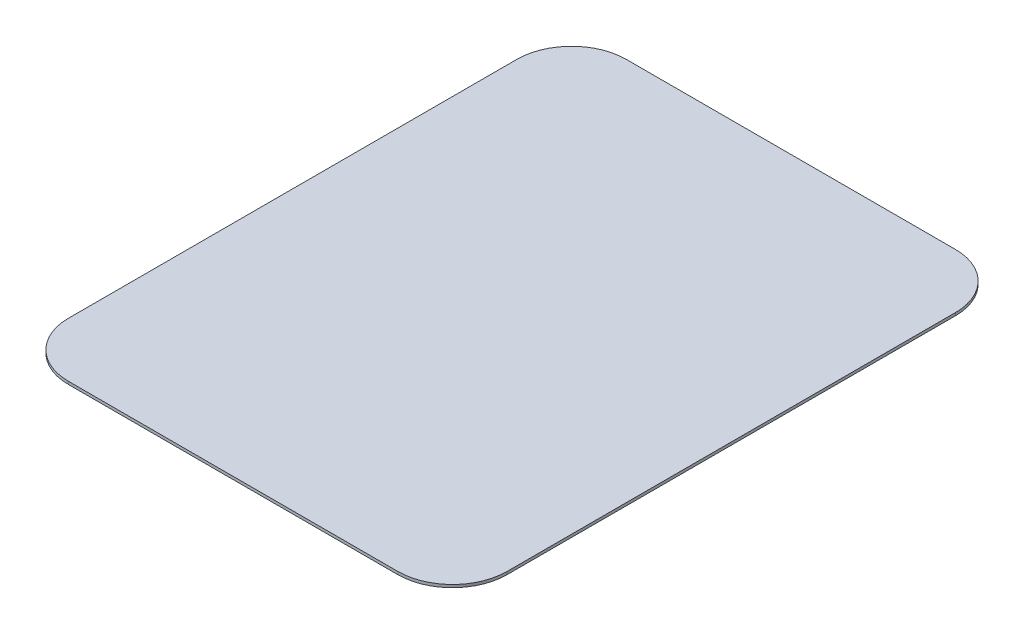
ISO-10303-21;
HEADER;
FILE_DESCRIPTION(('STEP AP214'),'2;1');
FILE_NAME('part.step','',(''),(''),'','','');
FILE_SCHEMA(('AUTOMOTIVE_DESIGN { 1 0 10303 214 1 1 1 1 }'));
ENDSEC;
DATA;
#1=APPLICATION_CONTEXT('core data for automotive mechanical design processes');
#2=APPLICATION_PROTOCOL_DEFINITION('international standard','automotive_design',2000,#1);
#3=PRODUCT_CONTEXT('',#1,'mechanical');
#4=PRODUCT('Part','Part','',(#3));
#5=PRODUCT_RELATED_PRODUCT_CATEGORY('part','',(#4));
#6=PRODUCT_DEFINITION_FORMATION('','',#4);
#7=PRODUCT_DEFINITION_CONTEXT('part definition',#1,'design');
#8=PRODUCT_DEFINITION('design','',#6,#7);
#9=PRODUCT_DEFINITION_SHAPE('','',#8);
#10=(LENGTH_UNIT() NAMED_UNIT(*) SI_UNIT(.MILLI.,.METRE.));
#11=(NAMED_UNIT(*) PLANE_ANGLE_UNIT() SI_UNIT($,.RADIAN.));
#12=(NAMED_UNIT(*) SI_UNIT($,.STERADIAN.) SOLID_ANGLE_UNIT());
#13=UNCERTAINTY_MEASURE_WITH_UNIT(LENGTH_MEASURE(1.E-05),#10,'distance_accuracy_value','');
#14=(GEOMETRIC_REPRESENTATION_CONTEXT(3) GLOBAL_UNCERTAINTY_ASSIGNED_CONTEXT((#13)) GLOBAL_UNIT_ASSIGNED_CONTEXT((#10,
#11,#12)) REPRESENTATION_CONTEXT('',''));
#15=CARTESIAN_POINT('',(0.,0.,0.));
#16=DIRECTION('',(0.,0.,1.));
#17=DIRECTION('',(1.,0.,0.));
#18=AXIS2_PLACEMENT_3D('',#15,#16,#17);
#19=CARTESIAN_POINT('',(11.75,13.,-15.9746901558539));
#20=DIRECTION('',(0.,-1.,0.));
#21=DIRECTION('',(0.,0.,-1.));
#22=AXIS2_PLACEMENT_3D('',#19,#20,#21);
#23=CYLINDRICAL_SURFACE('',#22,3.89825462644185);
#24=CARTESIAN_POINT('',(11.75,12.8,-15.9746901558539));
#25=DIRECTION('',(0.,1.,0.));
#26=DIRECTION('',(0.,0.,1.));
#27=AXIS2_PLACEMENT_3D('',#24,#25,#26);
#28=CIRCLE('',#27,3.89825462644185);
#29=CARTESIAN_POINT('',(15.6482546264418,12.8,-15.9746901558539));
#30=VERTEX_POINT('',#29);
#31=CARTESIAN_POINT('',(11.75,12.8,-19.8729447822958));
#32=VERTEX_POINT('',#31);
#33=EDGE_CURVE('E130',#30,#32,#28,.T.);
#34=ORIENTED_EDGE('',*,*,#33,.T.);
#35=DIRECTION('',(0.,-1.,0.));
#36=VECTOR('',#35,1.);
#37=CARTESIAN_POINT('',(11.75,13.,-19.8729447822958));
#38=LINE('',#37,#36);
#39=CARTESIAN_POINT('',(11.75,13.,-19.8729447822958));
#40=VERTEX_POINT('',#39);
#41=EDGE_CURVE('E11',#40,#32,#38,.T.);
#42=ORIENTED_EDGE('',*,*,#41,.F.);
#43=CARTESIAN_POINT('',(11.75,13.,-15.9746901558539));
#44=DIRECTION('',(0.,1.,0.));
#45=DIRECTION('',(0.,0.,1.));
#46=AXIS2_PLACEMENT_3D('',#43,#44,#45);
#47=CIRCLE('',#46,3.89825462644185);
#48=CARTESIAN_POINT('',(15.6482546264418,13.,-15.9746901558539));
#49=VERTEX_POINT('',#48);
#50=EDGE_CURVE('E144',#49,#40,#47,.T.);
#51=ORIENTED_EDGE('',*,*,#50,.F.);
#52=DIRECTION('',(0.,-1.,0.));
#53=VECTOR('',#52,1.);
#54=CARTESIAN_POINT('',(15.6482546264418,13.,-15.9746901558539));
#55=LINE('',#54,#53);
#56=EDGE_CURVE('E126',#49,#30,#55,.T.);
#57=ORIENTED_EDGE('',*,*,#56,.T.);
#58=EDGE_LOOP('',(#34,#42,#51,#57));
#59=FACE_BOUND('',#58,.T.);
#60=ADVANCED_FACE('F34',(#59),#23,.T.);
#61=CARTESIAN_POINT('',(11.75,13.,-19.8729447822958));
#62=DIRECTION('',(0.,0.,1.));
#63=DIRECTION('',(0.,-1.,0.));
#64=AXIS2_PLACEMENT_3D('',#61,#62,#63);
#65=PLANE('',#64);
#66=DIRECTION('',(-1.,0.,0.));
#67=VECTOR('',#66,1.);
#68=CARTESIAN_POINT('',(11.75,12.8,-19.8729447822958));
#69=LINE('',#68,#67);
#70=CARTESIAN_POINT('',(-11.75,12.8,-19.8729447822958));
#71=VERTEX_POINT('',#70);
#72=EDGE_CURVE('E133',#32,#71,#69,.T.);
#73=ORIENTED_EDGE('',*,*,#72,.T.);
#74=DIRECTION('',(0.,-1.,0.));
#75=VECTOR('',#74,1.);
#76=CARTESIAN_POINT('',(-11.75,13.,-19.8729447822958));
#77=LINE('',#76,#75);
#78=CARTESIAN_POINT('',(-11.75,13.,-19.8729447822958));
#79=VERTEX_POINT('',#78);
#80=EDGE_CURVE('E42',#79,#71,#77,.T.);
#81=ORIENTED_EDGE('',*,*,#80,.F.);
#82=DIRECTION('',(-1.,0.,0.));
#83=VECTOR('',#82,1.);
#84=CARTESIAN_POINT('',(11.75,13.,-19.8729447822958));
#85=LINE('',#84,#83);
#86=EDGE_CURVE('E93',#40,#79,#85,.T.);
#87=ORIENTED_EDGE('',*,*,#86,.F.);
#88=ORIENTED_EDGE('',*,*,#41,.T.);
#89=EDGE_LOOP('',(#73,#81,#87,#88));
#90=FACE_BOUND('',#89,.T.);
#91=ADVANCED_FACE('F179',(#90),#65,.F.);
#92=CARTESIAN_POINT('',(-11.75,13.,-15.9746901558539));
#93=DIRECTION('',(0.,-1.,0.));
#94=DIRECTION('',(0.,0.,-1.));
#95=AXIS2_PLACEMENT_3D('',#92,#93,#94);
#96=CYLINDRICAL_SURFACE('',#95,3.89825462644185);
#97=CARTESIAN_POINT('',(-11.75,12.8,-15.9746901558539));
#98=DIRECTION('',(0.,1.,0.));
#99=DIRECTION('',(0.,0.,1.));
#100=AXIS2_PLACEMENT_3D('',#97,#98,#99);
#101=CIRCLE('',#100,3.89825462644185);
#102=CARTESIAN_POINT('',(-15.6482546264419,12.8,-15.9746901558539));
#103=VERTEX_POINT('',#102);
#104=EDGE_CURVE('E135',#71,#103,#101,.T.);
#105=ORIENTED_EDGE('',*,*,#104,.T.);
#106=DIRECTION('',(0.,-1.,0.));
#107=VECTOR('',#106,1.);
#108=CARTESIAN_POINT('',(-15.6482546264419,13.,-15.9746901558539));
#109=LINE('',#108,#107);
#110=CARTESIAN_POINT('',(-15.6482546264419,13.,-15.9746901558539));
#111=VERTEX_POINT('',#110);
#112=EDGE_CURVE('E151',#111,#103,#109,.T.);
#113=ORIENTED_EDGE('',*,*,#112,.F.);
#114=CARTESIAN_POINT('',(-11.75,13.,-15.9746901558539));
#115=DIRECTION('',(0.,1.,0.));
#116=DIRECTION('',(0.,0.,1.));
#117=AXIS2_PLACEMENT_3D('',#114,#115,#116);
#118=CIRCLE('',#117,3.89825462644185);
#119=EDGE_CURVE('E159',#79,#111,#118,.T.);
#120=ORIENTED_EDGE('',*,*,#119,.F.);
#121=ORIENTED_EDGE('',*,*,#80,.T.);
#122=EDGE_LOOP('',(#105,#113,#120,#121));
#123=FACE_BOUND('',#122,.T.);
#124=ADVANCED_FACE('F157',(#123),#96,.T.);
#125=CARTESIAN_POINT('',(-15.6482546264419,13.,-15.9746901558539));
#126=DIRECTION('',(1.,0.,0.));
#127=DIRECTION('',(0.,0.,-1.));
#128=AXIS2_PLACEMENT_3D('',#125,#126,#127);
#129=PLANE('',#128);
#130=DIRECTION('',(0.,0.,1.));
#131=VECTOR('',#130,1.);
#132=CARTESIAN_POINT('',(-15.6482546264419,12.8,-15.9746901558539));
#133=LINE('',#132,#131);
#134=CARTESIAN_POINT('',(-15.6482546264418,12.8,16.0253098441461));
#135=VERTEX_POINT('',#134);
#136=EDGE_CURVE('E137',#103,#135,#133,.T.);
#137=ORIENTED_EDGE('',*,*,#136,.T.);
#138=DIRECTION('',(0.,-1.,0.));
#139=VECTOR('',#138,1.);
#140=CARTESIAN_POINT('',(-15.6482546264418,13.,16.0253098441461));
#141=LINE('',#140,#139);
#142=CARTESIAN_POINT('',(-15.6482546264418,13.,16.0253098441461));
#143=VERTEX_POINT('',#142);
#144=EDGE_CURVE('E148',#143,#135,#141,.T.);
#145=ORIENTED_EDGE('',*,*,#144,.F.);
#146=DIRECTION('',(0.,0.,1.));
#147=VECTOR('',#146,1.);
#148=CARTESIAN_POINT('',(-15.6482546264419,13.,-15.9746901558539));
#149=LINE('',#148,#147);
#150=EDGE_CURVE('E171',#111,#143,#149,.T.);
#151=ORIENTED_EDGE('',*,*,#150,.F.);
#152=ORIENTED_EDGE('',*,*,#112,.T.);
#153=EDGE_LOOP('',(#137,#145,#151,#152));
#154=FACE_BOUND('',#153,.T.);
#155=ADVANCED_FACE('F167',(#154),#129,.F.);
#156=CARTESIAN_POINT('',(-11.75,13.,16.0253098441461));
#157=DIRECTION('',(0.,-1.,0.));
#158=DIRECTION('',(0.,0.,-1.));
#159=AXIS2_PLACEMENT_3D('',#156,#157,#158);
#160=CYLINDRICAL_SURFACE('',#159,3.89825462644185);
#161=CARTESIAN_POINT('',(-11.75,12.8,16.0253098441461));
#162=DIRECTION('',(0.,1.,0.));
#163=DIRECTION('',(0.,0.,1.));
#164=AXIS2_PLACEMENT_3D('',#161,#162,#163);
#165=CIRCLE('',#164,3.89825462644185);
#166=CARTESIAN_POINT('',(-11.75,12.8,19.9235644705879));
#167=VERTEX_POINT('',#166);
#168=EDGE_CURVE('E139',#135,#167,#165,.T.);
#169=ORIENTED_EDGE('',*,*,#168,.T.);
#170=DIRECTION('',(0.,-1.,0.));
#171=VECTOR('',#170,1.);
#172=CARTESIAN_POINT('',(-11.75,13.,19.9235644705879));
#173=LINE('',#172,#171);
#174=CARTESIAN_POINT('',(-11.75,13.,19.9235644705879));
#175=VERTEX_POINT('',#174);
#176=EDGE_CURVE('E121',#175,#167,#173,.T.);
#177=ORIENTED_EDGE('',*,*,#176,.F.);
#178=CARTESIAN_POINT('',(-11.75,13.,16.0253098441461));
#179=DIRECTION('',(0.,1.,0.));
#180=DIRECTION('',(0.,0.,1.));
#181=AXIS2_PLACEMENT_3D('',#178,#179,#180);
#182=CIRCLE('',#181,3.89825462644185);
#183=EDGE_CURVE('E112',#143,#175,#182,.T.);
#184=ORIENTED_EDGE('',*,*,#183,.F.);
#185=ORIENTED_EDGE('',*,*,#144,.T.);
#186=EDGE_LOOP('',(#169,#177,#184,#185));
#187=FACE_BOUND('',#186,.T.);
#188=ADVANCED_FACE('F170',(#187),#160,.T.);
#189=CARTESIAN_POINT('',(-11.75,13.,19.9235644705879));
#190=DIRECTION('',(0.,0.,-1.));
#191=DIRECTION('',(0.,1.,0.));
#192=AXIS2_PLACEMENT_3D('',#189,#190,#191);
#193=PLANE('',#192);
#194=DIRECTION('',(1.,0.,0.));
#195=VECTOR('',#194,1.);
#196=CARTESIAN_POINT('',(-11.75,12.8,19.9235644705879));
#197=LINE('',#196,#195);
#198=CARTESIAN_POINT('',(11.75,12.8,19.9235644705879));
#199=VERTEX_POINT('',#198);
#200=EDGE_CURVE('E120',#167,#199,#197,.T.);
#201=ORIENTED_EDGE('',*,*,#200,.T.);
#202=DIRECTION('',(0.,-1.,0.));
#203=VECTOR('',#202,1.);
#204=CARTESIAN_POINT('',(11.75,13.,19.9235644705879));
#205=LINE('',#204,#203);
#206=CARTESIAN_POINT('',(11.75,13.,19.9235644705879));
#207=VERTEX_POINT('',#206);
#208=EDGE_CURVE('E117',#207,#199,#205,.T.);
#209=ORIENTED_EDGE('',*,*,#208,.F.);
#210=DIRECTION('',(1.,0.,0.));
#211=VECTOR('',#210,1.);
#212=CARTESIAN_POINT('',(-11.75,13.,19.9235644705879));
#213=LINE('',#212,#211);
#214=EDGE_CURVE('E106',#175,#207,#213,.T.);
#215=ORIENTED_EDGE('',*,*,#214,.F.);
#216=ORIENTED_EDGE('',*,*,#176,.T.);
#217=EDGE_LOOP('',(#201,#209,#215,#216));
#218=FACE_BOUND('',#217,.T.);
#219=ADVANCED_FACE('F118',(#218),#193,.F.);
#220=CARTESIAN_POINT('',(11.75,13.,16.0253098441461));
#221=DIRECTION('',(0.,-1.,0.));
#222=DIRECTION('',(0.,0.,-1.));
#223=AXIS2_PLACEMENT_3D('',#220,#221,#222);
#224=CYLINDRICAL_SURFACE('',#223,3.89825462644185);
#225=CARTESIAN_POINT('',(11.75,12.8,16.0253098441461));
#226=DIRECTION('',(0.,1.,0.));
#227=DIRECTION('',(0.,0.,1.));
#228=AXIS2_PLACEMENT_3D('',#225,#226,#227);
#229=CIRCLE('',#228,3.89825462644185);
#230=CARTESIAN_POINT('',(15.6482546264418,12.8,16.0253098441461));
#231=VERTEX_POINT('',#230);
#232=EDGE_CURVE('E79',#199,#231,#229,.T.);
#233=ORIENTED_EDGE('',*,*,#232,.T.);
#234=DIRECTION('',(0.,-1.,0.));
#235=VECTOR('',#234,1.);
#236=CARTESIAN_POINT('',(15.6482546264418,13.,16.0253098441461));
#237=LINE('',#236,#235);
#238=CARTESIAN_POINT('',(15.6482546264418,13.,16.0253098441461));
#239=VERTEX_POINT('',#238);
#240=EDGE_CURVE('E122',#239,#231,#237,.T.);
#241=ORIENTED_EDGE('',*,*,#240,.F.);
#242=CARTESIAN_POINT('',(11.75,13.,16.0253098441461));
#243=DIRECTION('',(0.,1.,0.));
#244=DIRECTION('',(0.,0.,1.));
#245=AXIS2_PLACEMENT_3D('',#242,#243,#244);
#246=CIRCLE('',#245,3.89825462644185);
#247=EDGE_CURVE('E110',#207,#239,#246,.T.);
#248=ORIENTED_EDGE('',*,*,#247,.F.);
#249=ORIENTED_EDGE('',*,*,#208,.T.);
#250=EDGE_LOOP('',(#233,#241,#248,#249));
#251=FACE_BOUND('',#250,.T.);
#252=ADVANCED_FACE('F124',(#251),#224,.T.);
#253=CARTESIAN_POINT('',(15.6482546264418,13.,16.0253098441461));
#254=DIRECTION('',(-1.,0.,0.));
#255=DIRECTION('',(0.,-1.,0.));
#256=AXIS2_PLACEMENT_3D('',#253,#254,#255);
#257=PLANE('',#256);
#258=DIRECTION('',(0.,0.,-1.));
#259=VECTOR('',#258,1.);
#260=CARTESIAN_POINT('',(15.6482546264418,12.8,16.0253098441461));
#261=LINE('',#260,#259);
#262=EDGE_CURVE('E85',#231,#30,#261,.T.);
#263=ORIENTED_EDGE('',*,*,#262,.T.);
#264=ORIENTED_EDGE('',*,*,#56,.F.);
#265=DIRECTION('',(0.,0.,-1.));
#266=VECTOR('',#265,1.);
#267=CARTESIAN_POINT('',(15.6482546264418,13.,16.0253098441461));
#268=LINE('',#267,#266);
#269=EDGE_CURVE('E50',#239,#49,#268,.T.);
#270=ORIENTED_EDGE('',*,*,#269,.F.);
#271=ORIENTED_EDGE('',*,*,#240,.T.);
#272=EDGE_LOOP('',(#263,#264,#270,#271));
#273=FACE_BOUND('',#272,.T.);
#274=ADVANCED_FACE('F195',(#273),#257,.F.);
#275=CARTESIAN_POINT('',(11.75,13.,-15.9746901558539));
#276=DIRECTION('',(0.,1.,0.));
#277=DIRECTION('',(0.,0.,1.));
#278=AXIS2_PLACEMENT_3D('',#275,#276,#277);
#279=PLANE('',#278);
#280=ORIENTED_EDGE('',*,*,#50,.T.);
#281=ORIENTED_EDGE('',*,*,#86,.T.);
#282=ORIENTED_EDGE('',*,*,#119,.T.);
#283=ORIENTED_EDGE('',*,*,#150,.T.);
#284=ORIENTED_EDGE('',*,*,#183,.T.);
#285=ORIENTED_EDGE('',*,*,#214,.T.);
#286=ORIENTED_EDGE('',*,*,#247,.T.);
#287=ORIENTED_EDGE('',*,*,#269,.T.);
#288=EDGE_LOOP('',(#280,#281,#282,#283,#284,#285,#286,#287));
#289=FACE_BOUND('',#288,.T.);
#290=ADVANCED_FACE('F108',(#289),#279,.T.);
#291=CARTESIAN_POINT('',(11.75,12.8,-15.9746901558539));
#292=DIRECTION('',(0.,1.,0.));
#293=DIRECTION('',(0.,0.,1.));
#294=AXIS2_PLACEMENT_3D('',#291,#292,#293);
#295=PLANE('',#294);
#296=ORIENTED_EDGE('',*,*,#33,.F.);
#297=ORIENTED_EDGE('',*,*,#262,.F.);
#298=ORIENTED_EDGE('',*,*,#232,.F.);
#299=ORIENTED_EDGE('',*,*,#200,.F.);
#300=ORIENTED_EDGE('',*,*,#168,.F.);
#301=ORIENTED_EDGE('',*,*,#136,.F.);
#302=ORIENTED_EDGE('',*,*,#104,.F.);
#303=ORIENTED_EDGE('',*,*,#72,.F.);
#304=EDGE_LOOP('',(#296,#297,#298,#299,#300,#301,#302,#303));
#305=FACE_BOUND('',#304,.T.);
#306=ADVANCED_FACE('F163',(#305),#295,.F.);
#307=CLOSED_SHELL('',(#60,#91,#124,#155,#188,#219,#252,#274,#290,#306));
#308=MANIFOLD_SOLID_BREP('B2',#307);
#309=ADVANCED_BREP_SHAPE_REPRESENTATION('',(#18,#308),#14);
#310=SHAPE_DEFINITION_REPRESENTATION(#9,#309);
ENDSEC;
END-ISO-10303-21;
